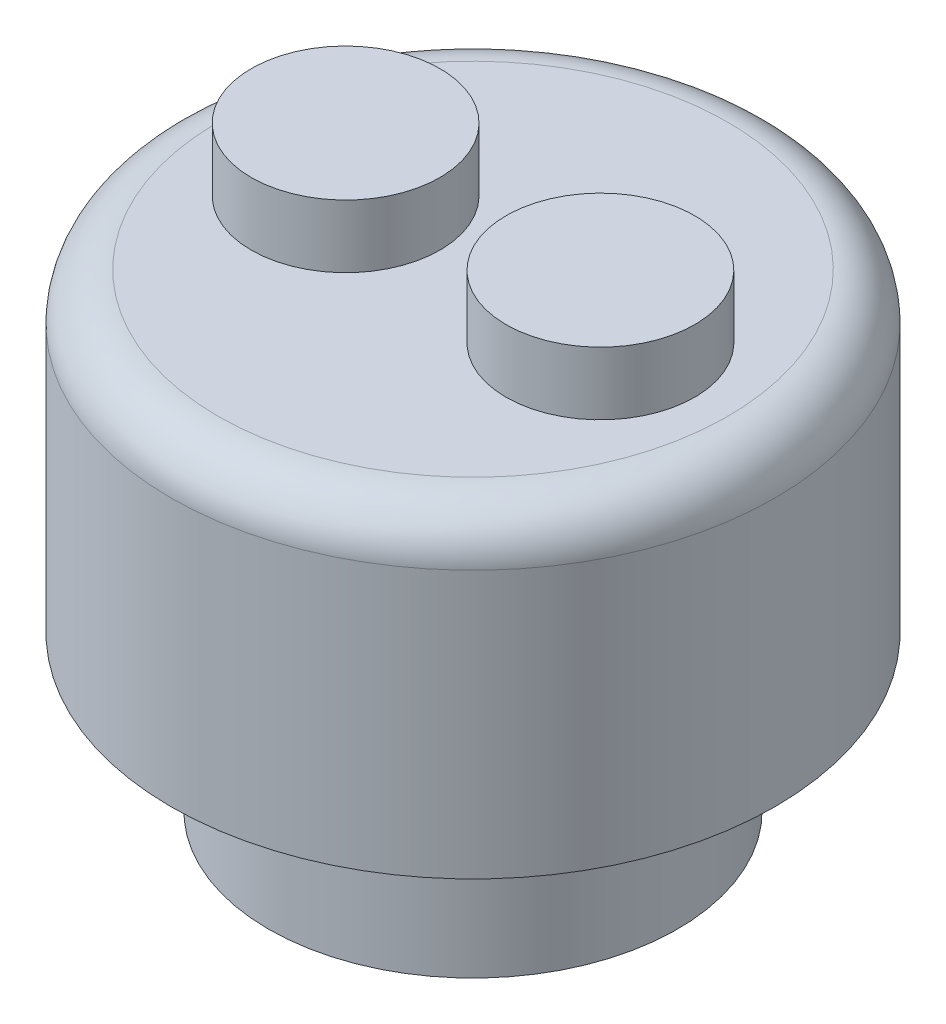
ISO-10303-21;
HEADER;
FILE_DESCRIPTION(('STEP AP214'),'2;1');
FILE_NAME('part.step','',(''),(''),'','','');
FILE_SCHEMA(('AUTOMOTIVE_DESIGN { 1 0 10303 214 1 1 1 1 }'));
ENDSEC;
DATA;
#1=APPLICATION_CONTEXT('core data for automotive mechanical design processes');
#2=APPLICATION_PROTOCOL_DEFINITION('international standard','automotive_design',2000,#1);
#3=PRODUCT_CONTEXT('',#1,'mechanical');
#4=PRODUCT('Part','Part','',(#3));
#5=PRODUCT_RELATED_PRODUCT_CATEGORY('part','',(#4));
#6=PRODUCT_DEFINITION_FORMATION('','',#4);
#7=PRODUCT_DEFINITION_CONTEXT('part definition',#1,'design');
#8=PRODUCT_DEFINITION('design','',#6,#7);
#9=PRODUCT_DEFINITION_SHAPE('','',#8);
#10=(LENGTH_UNIT() NAMED_UNIT(*) SI_UNIT(.MILLI.,.METRE.));
#11=(NAMED_UNIT(*) PLANE_ANGLE_UNIT() SI_UNIT($,.RADIAN.));
#12=(NAMED_UNIT(*) SI_UNIT($,.STERADIAN.) SOLID_ANGLE_UNIT());
#13=UNCERTAINTY_MEASURE_WITH_UNIT(LENGTH_MEASURE(1.E-05),#10,'distance_accuracy_value','');
#14=(GEOMETRIC_REPRESENTATION_CONTEXT(3) GLOBAL_UNCERTAINTY_ASSIGNED_CONTEXT((#13)) GLOBAL_UNIT_ASSIGNED_CONTEXT((#10,
#11,#12)) REPRESENTATION_CONTEXT('',''));
#15=CARTESIAN_POINT('',(0.,0.,0.));
#16=DIRECTION('',(0.,0.,1.));
#17=DIRECTION('',(1.,0.,0.));
#18=AXIS2_PLACEMENT_3D('',#15,#16,#17);
#19=CARTESIAN_POINT('',(0.,2.46,0.));
#20=DIRECTION('',(0.,-1.,0.));
#21=DIRECTION('',(0.,0.,-1.));
#22=AXIS2_PLACEMENT_3D('',#19,#20,#21);
#23=CYLINDRICAL_SURFACE('',#22,3.25);
#24=CARTESIAN_POINT('',(0.,2.46,0.));
#25=DIRECTION('',(0.,1.,0.));
#26=DIRECTION('',(0.,0.,1.));
#27=AXIS2_PLACEMENT_3D('',#24,#25,#26);
#28=CIRCLE('',#27,3.25);
#29=CARTESIAN_POINT('',(0.,2.46,3.25));
#30=VERTEX_POINT('',#29);
#31=EDGE_CURVE('E112',#30,#30,#28,.T.);
#32=ORIENTED_EDGE('',*,*,#31,.F.);
#33=EDGE_LOOP('',(#32));
#34=FACE_BOUND('',#33,.T.);
#35=CARTESIAN_POINT('',(0.,0.,0.));
#36=DIRECTION('',(0.,1.,0.));
#37=DIRECTION('',(0.,0.,1.));
#38=AXIS2_PLACEMENT_3D('',#35,#36,#37);
#39=CIRCLE('',#38,3.25);
#40=CARTESIAN_POINT('',(0.,0.,3.25));
#41=VERTEX_POINT('',#40);
#42=EDGE_CURVE('E117',#41,#41,#39,.T.);
#43=ORIENTED_EDGE('',*,*,#42,.T.);
#44=EDGE_LOOP('',(#43));
#45=FACE_BOUND('',#44,.T.);
#46=ADVANCED_FACE('F99',(#34,#45),#23,.T.);
#47=CARTESIAN_POINT('',(0.,0.,0.));
#48=DIRECTION('',(0.,1.,0.));
#49=DIRECTION('',(0.,0.,1.));
#50=AXIS2_PLACEMENT_3D('',#47,#48,#49);
#51=PLANE('',#50);
#52=CARTESIAN_POINT('',(0.,0.,0.));
#53=DIRECTION('',(0.,-1.,0.));
#54=DIRECTION('',(0.,0.,-1.));
#55=AXIS2_PLACEMENT_3D('',#52,#53,#54);
#56=CIRCLE('',#55,1.75);
#57=CARTESIAN_POINT('',(0.,0.,-1.75));
#58=VERTEX_POINT('',#57);
#59=EDGE_CURVE('E122',#58,#58,#56,.T.);
#60=ORIENTED_EDGE('',*,*,#59,.F.);
#61=EDGE_LOOP('',(#60));
#62=FACE_BOUND('',#61,.T.);
#63=ORIENTED_EDGE('',*,*,#42,.F.);
#64=EDGE_LOOP('',(#63));
#65=FACE_BOUND('',#64,.T.);
#66=ADVANCED_FACE('F177',(#62,#65),#51,.F.);
#67=CARTESIAN_POINT('',(0.,2.5,0.));
#68=DIRECTION('',(0.,-1.,0.));
#69=DIRECTION('',(0.,0.,-1.));
#70=AXIS2_PLACEMENT_3D('',#67,#68,#69);
#71=CYLINDRICAL_SURFACE('',#70,1.75);
#72=CARTESIAN_POINT('',(0.,2.46,0.));
#73=DIRECTION('',(0.,1.,0.));
#74=DIRECTION('',(0.,0.,1.));
#75=AXIS2_PLACEMENT_3D('',#72,#73,#74);
#76=CIRCLE('',#75,1.75);
#77=CARTESIAN_POINT('',(0.,2.46,1.75));
#78=VERTEX_POINT('',#77);
#79=EDGE_CURVE('E124',#78,#78,#76,.T.);
#80=ORIENTED_EDGE('',*,*,#79,.T.);
#81=EDGE_LOOP('',(#80));
#82=FACE_BOUND('',#81,.T.);
#83=ORIENTED_EDGE('',*,*,#59,.T.);
#84=EDGE_LOOP('',(#83));
#85=FACE_BOUND('',#84,.T.);
#86=ADVANCED_FACE('F182',(#82,#85),#71,.F.);
#87=CARTESIAN_POINT('',(0.,2.46,0.));
#88=DIRECTION('',(0.,1.,0.));
#89=DIRECTION('',(0.,0.,1.));
#90=AXIS2_PLACEMENT_3D('',#87,#88,#89);
#91=PLANE('',#90);
#92=ORIENTED_EDGE('',*,*,#31,.T.);
#93=EDGE_LOOP('',(#92));
#94=FACE_BOUND('',#93,.T.);
#95=CARTESIAN_POINT('',(0.,2.46,0.));
#96=DIRECTION('',(0.,1.,0.));
#97=DIRECTION('',(0.,0.,1.));
#98=AXIS2_PLACEMENT_3D('',#95,#96,#97);
#99=CIRCLE('',#98,4.8);
#100=CARTESIAN_POINT('',(0.,2.46,4.8));
#101=VERTEX_POINT('',#100);
#102=EDGE_CURVE('E128',#101,#101,#99,.T.);
#103=ORIENTED_EDGE('',*,*,#102,.F.);
#104=EDGE_LOOP('',(#103));
#105=FACE_BOUND('',#104,.T.);
#106=ADVANCED_FACE('F158',(#94,#105),#91,.F.);
#107=CARTESIAN_POINT('',(0.,7.46,0.));
#108=DIRECTION('',(0.,1.,0.));
#109=DIRECTION('',(0.,0.,1.));
#110=AXIS2_PLACEMENT_3D('',#107,#108,#109);
#111=PLANE('',#110);
#112=CARTESIAN_POINT('',(2.025,7.46,0.));
#113=DIRECTION('',(0.,1.,0.));
#114=DIRECTION('',(0.,0.,1.));
#115=AXIS2_PLACEMENT_3D('',#112,#113,#114);
#116=CIRCLE('',#115,1.5);
#117=CARTESIAN_POINT('',(2.025,7.46,1.5));
#118=VERTEX_POINT('',#117);
#119=EDGE_CURVE('E140',#118,#118,#116,.T.);
#120=ORIENTED_EDGE('',*,*,#119,.F.);
#121=EDGE_LOOP('',(#120));
#122=FACE_BOUND('',#121,.T.);
#123=CARTESIAN_POINT('',(-2.025,7.46,0.));
#124=DIRECTION('',(0.,1.,0.));
#125=DIRECTION('',(0.,0.,1.));
#126=AXIS2_PLACEMENT_3D('',#123,#124,#125);
#127=CIRCLE('',#126,1.5);
#128=CARTESIAN_POINT('',(-2.025,7.46,1.5));
#129=VERTEX_POINT('',#128);
#130=EDGE_CURVE('E136',#129,#129,#127,.T.);
#131=ORIENTED_EDGE('',*,*,#130,.F.);
#132=EDGE_LOOP('',(#131));
#133=FACE_BOUND('',#132,.T.);
#134=CARTESIAN_POINT('',(0.,7.46,0.));
#135=DIRECTION('',(0.,1.,0.));
#136=DIRECTION('',(0.,0.,1.));
#137=AXIS2_PLACEMENT_3D('',#134,#135,#136);
#138=CIRCLE('',#137,4.05);
#139=CARTESIAN_POINT('',(0.,7.46,4.05));
#140=VERTEX_POINT('',#139);
#141=EDGE_CURVE('E107',#140,#140,#138,.T.);
#142=ORIENTED_EDGE('',*,*,#141,.T.);
#143=EDGE_LOOP('',(#142));
#144=FACE_BOUND('',#143,.T.);
#145=ADVANCED_FACE('F154',(#122,#133,#144),#111,.T.);
#146=CARTESIAN_POINT('',(0.,7.46,0.));
#147=DIRECTION('',(0.,-1.,0.));
#148=DIRECTION('',(0.,0.,-1.));
#149=AXIS2_PLACEMENT_3D('',#146,#147,#148);
#150=CYLINDRICAL_SURFACE('',#149,4.8);
#151=CARTESIAN_POINT('',(0.,6.71,0.));
#152=DIRECTION('',(0.,1.,0.));
#153=DIRECTION('',(0.,0.,1.));
#154=AXIS2_PLACEMENT_3D('',#151,#152,#153);
#155=CIRCLE('',#154,4.8);
#156=CARTESIAN_POINT('',(0.,6.71,4.8));
#157=VERTEX_POINT('',#156);
#158=EDGE_CURVE('E11',#157,#157,#155,.F.);
#159=ORIENTED_EDGE('',*,*,#158,.T.);
#160=EDGE_LOOP('',(#159));
#161=FACE_BOUND('',#160,.T.);
#162=ORIENTED_EDGE('',*,*,#102,.T.);
#163=EDGE_LOOP('',(#162));
#164=FACE_BOUND('',#163,.T.);
#165=ADVANCED_FACE('F157',(#161,#164),#150,.T.);
#166=ORIENTED_EDGE('',*,*,#79,.F.);
#167=EDGE_LOOP('',(#166));
#168=FACE_BOUND('',#167,.T.);
#169=ADVANCED_FACE('F173',(#168),#91,.F.);
#170=CARTESIAN_POINT('',(0.,6.71,0.));
#171=DIRECTION('',(0.,1.,0.));
#172=DIRECTION('',(0.,0.,1.));
#173=AXIS2_PLACEMENT_3D('',#170,#171,#172);
#174=TOROIDAL_SURFACE('',#173,4.05,0.75);
#175=ORIENTED_EDGE('',*,*,#158,.F.);
#176=EDGE_LOOP('',(#175));
#177=FACE_BOUND('',#176,.T.);
#178=ORIENTED_EDGE('',*,*,#141,.F.);
#179=EDGE_LOOP('',(#178));
#180=FACE_BOUND('',#179,.T.);
#181=ADVANCED_FACE('F101',(#177,#180),#174,.T.);
#182=CARTESIAN_POINT('',(-2.025,8.46,0.));
#183=DIRECTION('',(0.,-1.,0.));
#184=DIRECTION('',(0.,0.,-1.));
#185=AXIS2_PLACEMENT_3D('',#182,#183,#184);
#186=CYLINDRICAL_SURFACE('',#185,1.5);
#187=CARTESIAN_POINT('',(-2.025,8.46,0.));
#188=DIRECTION('',(0.,1.,0.));
#189=DIRECTION('',(0.,0.,1.));
#190=AXIS2_PLACEMENT_3D('',#187,#188,#189);
#191=CIRCLE('',#190,1.5);
#192=CARTESIAN_POINT('',(-2.025,8.46,1.5));
#193=VERTEX_POINT('',#192);
#194=EDGE_CURVE('E135',#193,#193,#191,.T.);
#195=ORIENTED_EDGE('',*,*,#194,.F.);
#196=EDGE_LOOP('',(#195));
#197=FACE_BOUND('',#196,.T.);
#198=ORIENTED_EDGE('',*,*,#130,.T.);
#199=EDGE_LOOP('',(#198));
#200=FACE_BOUND('',#199,.T.);
#201=ADVANCED_FACE('F162',(#197,#200),#186,.T.);
#202=CARTESIAN_POINT('',(-2.025,8.46,0.));
#203=DIRECTION('',(0.,1.,0.));
#204=DIRECTION('',(0.,0.,1.));
#205=AXIS2_PLACEMENT_3D('',#202,#203,#204);
#206=PLANE('',#205);
#207=ORIENTED_EDGE('',*,*,#194,.T.);
#208=EDGE_LOOP('',(#207));
#209=FACE_BOUND('',#208,.T.);
#210=ADVANCED_FACE('F164',(#209),#206,.T.);
#211=CARTESIAN_POINT('',(2.025,8.46,0.));
#212=DIRECTION('',(0.,-1.,0.));
#213=DIRECTION('',(0.,0.,-1.));
#214=AXIS2_PLACEMENT_3D('',#211,#212,#213);
#215=CYLINDRICAL_SURFACE('',#214,1.5);
#216=CARTESIAN_POINT('',(2.025,8.46,0.));
#217=DIRECTION('',(0.,1.,0.));
#218=DIRECTION('',(0.,0.,1.));
#219=AXIS2_PLACEMENT_3D('',#216,#217,#218);
#220=CIRCLE('',#219,1.5);
#221=CARTESIAN_POINT('',(2.025,8.46,1.5));
#222=VERTEX_POINT('',#221);
#223=EDGE_CURVE('E144',#222,#222,#220,.T.);
#224=ORIENTED_EDGE('',*,*,#223,.F.);
#225=EDGE_LOOP('',(#224));
#226=FACE_BOUND('',#225,.T.);
#227=ORIENTED_EDGE('',*,*,#119,.T.);
#228=EDGE_LOOP('',(#227));
#229=FACE_BOUND('',#228,.T.);
#230=ADVANCED_FACE('F152',(#226,#229),#215,.T.);
#231=CARTESIAN_POINT('',(2.025,8.46,0.));
#232=DIRECTION('',(0.,1.,0.));
#233=DIRECTION('',(0.,0.,1.));
#234=AXIS2_PLACEMENT_3D('',#231,#232,#233);
#235=PLANE('',#234);
#236=ORIENTED_EDGE('',*,*,#223,.T.);
#237=EDGE_LOOP('',(#236));
#238=FACE_BOUND('',#237,.T.);
#239=ADVANCED_FACE('F263',(#238),#235,.T.);
#240=CLOSED_SHELL('',(#46,#66,#86,#106,#145,#165,#169,#181,#201,#210,#230,#239));
#241=MANIFOLD_SOLID_BREP('B2',#240);
#242=ADVANCED_BREP_SHAPE_REPRESENTATION('',(#18,#241),#14);
#243=SHAPE_DEFINITION_REPRESENTATION(#9,#242);
ENDSEC;
END-ISO-10303-21;
